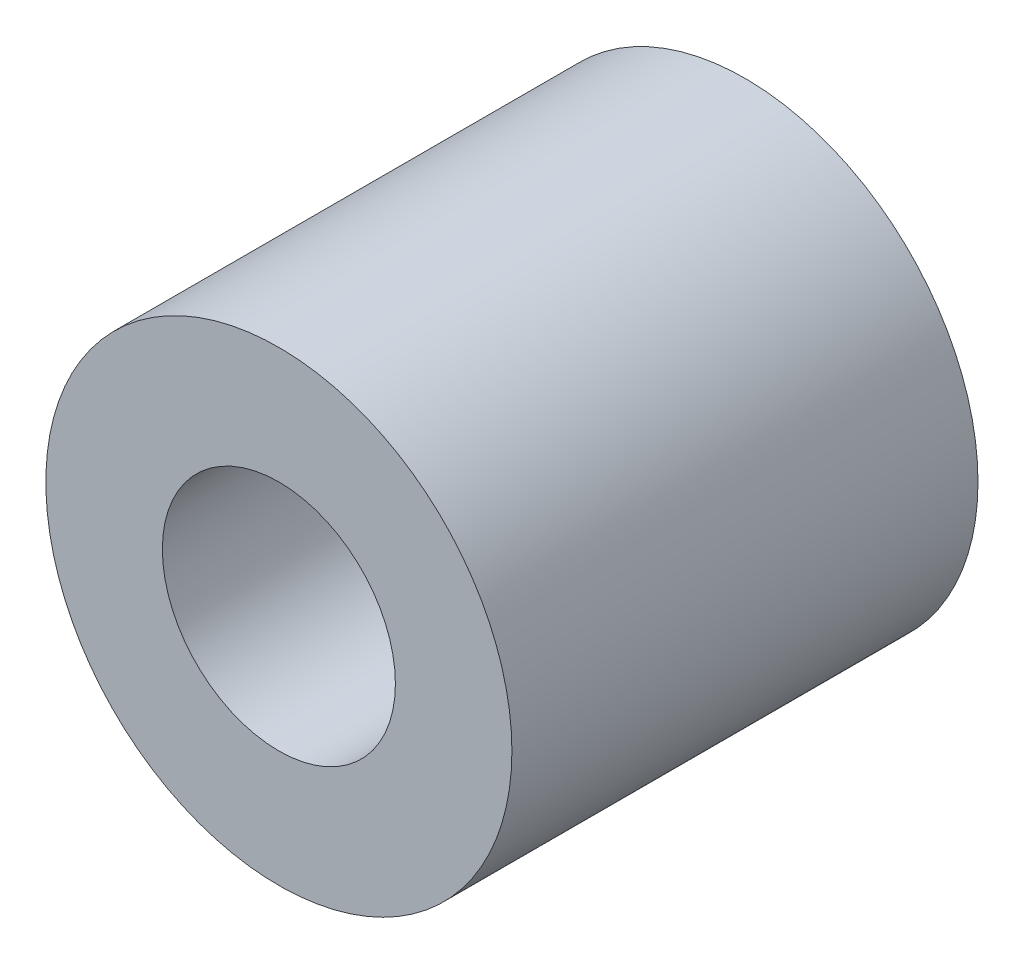
ISO-10303-21;
HEADER;
FILE_DESCRIPTION(('STEP AP214'),'2;1');
FILE_NAME('part.step','',(''),(''),'','','');
FILE_SCHEMA(('AUTOMOTIVE_DESIGN { 1 0 10303 214 1 1 1 1 }'));
ENDSEC;
DATA;
#1=APPLICATION_CONTEXT('core data for automotive mechanical design processes');
#2=APPLICATION_PROTOCOL_DEFINITION('international standard','automotive_design',2000,#1);
#3=PRODUCT_CONTEXT('',#1,'mechanical');
#4=PRODUCT('Part','Part','',(#3));
#5=PRODUCT_RELATED_PRODUCT_CATEGORY('part','',(#4));
#6=PRODUCT_DEFINITION_FORMATION('','',#4);
#7=PRODUCT_DEFINITION_CONTEXT('part definition',#1,'design');
#8=PRODUCT_DEFINITION('design','',#6,#7);
#9=PRODUCT_DEFINITION_SHAPE('','',#8);
#10=(LENGTH_UNIT() NAMED_UNIT(*) SI_UNIT(.MILLI.,.METRE.));
#11=(NAMED_UNIT(*) PLANE_ANGLE_UNIT() SI_UNIT($,.RADIAN.));
#12=(NAMED_UNIT(*) SI_UNIT($,.STERADIAN.) SOLID_ANGLE_UNIT());
#13=UNCERTAINTY_MEASURE_WITH_UNIT(LENGTH_MEASURE(1.E-05),#10,'distance_accuracy_value','');
#14=(GEOMETRIC_REPRESENTATION_CONTEXT(3) GLOBAL_UNCERTAINTY_ASSIGNED_CONTEXT((#13)) GLOBAL_UNIT_ASSIGNED_CONTEXT((#10,
#11,#12)) REPRESENTATION_CONTEXT('',''));
#15=CARTESIAN_POINT('',(0.,0.,0.));
#16=DIRECTION('',(0.,0.,1.));
#17=DIRECTION('',(1.,0.,0.));
#18=AXIS2_PLACEMENT_3D('',#15,#16,#17);
#19=CARTESIAN_POINT('',(0.,0.,25.4));
#20=DIRECTION('',(0.,0.,-1.));
#21=DIRECTION('',(-1.,0.,0.));
#22=AXIS2_PLACEMENT_3D('',#19,#20,#21);
#23=CYLINDRICAL_SURFACE('',#22,12.7);
#24=CARTESIAN_POINT('',(0.,0.,25.4));
#25=DIRECTION('',(0.,0.,1.));
#26=DIRECTION('',(1.,0.,0.));
#27=AXIS2_PLACEMENT_3D('',#24,#25,#26);
#28=CIRCLE('',#27,12.7);
#29=CARTESIAN_POINT('',(12.7,0.,25.4));
#30=VERTEX_POINT('',#29);
#31=EDGE_CURVE('E10',#30,#30,#28,.T.);
#32=ORIENTED_EDGE('',*,*,#31,.F.);
#33=EDGE_LOOP('',(#32));
#34=FACE_BOUND('',#33,.T.);
#35=CARTESIAN_POINT('',(0.,0.,0.));
#36=DIRECTION('',(0.,0.,1.));
#37=DIRECTION('',(1.,0.,0.));
#38=AXIS2_PLACEMENT_3D('',#35,#36,#37);
#39=CIRCLE('',#38,12.7);
#40=CARTESIAN_POINT('',(12.7,0.,0.));
#41=VERTEX_POINT('',#40);
#42=EDGE_CURVE('E40',#41,#41,#39,.T.);
#43=ORIENTED_EDGE('',*,*,#42,.T.);
#44=EDGE_LOOP('',(#43));
#45=FACE_BOUND('',#44,.T.);
#46=ADVANCED_FACE('F37',(#34,#45),#23,.T.);
#47=CARTESIAN_POINT('',(0.,0.,25.4));
#48=DIRECTION('',(0.,0.,1.));
#49=DIRECTION('',(1.,0.,0.));
#50=AXIS2_PLACEMENT_3D('',#47,#48,#49);
#51=PLANE('',#50);
#52=CARTESIAN_POINT('',(0.,0.,25.4));
#53=DIRECTION('',(0.,0.,1.));
#54=DIRECTION('',(1.,0.,0.));
#55=AXIS2_PLACEMENT_3D('',#52,#53,#54);
#56=CIRCLE('',#55,6.35);
#57=CARTESIAN_POINT('',(6.35,0.,25.4));
#58=VERTEX_POINT('',#57);
#59=EDGE_CURVE('E51',#58,#58,#56,.T.);
#60=ORIENTED_EDGE('',*,*,#59,.F.);
#61=EDGE_LOOP('',(#60));
#62=FACE_BOUND('',#61,.T.);
#63=ORIENTED_EDGE('',*,*,#31,.T.);
#64=EDGE_LOOP('',(#63));
#65=FACE_BOUND('',#64,.T.);
#66=ADVANCED_FACE('F68',(#62,#65),#51,.T.);
#67=CARTESIAN_POINT('',(0.,0.,0.));
#68=DIRECTION('',(0.,0.,1.));
#69=DIRECTION('',(1.,0.,0.));
#70=AXIS2_PLACEMENT_3D('',#67,#68,#69);
#71=PLANE('',#70);
#72=CARTESIAN_POINT('',(0.,0.,0.));
#73=DIRECTION('',(0.,0.,1.));
#74=DIRECTION('',(1.,0.,0.));
#75=AXIS2_PLACEMENT_3D('',#72,#73,#74);
#76=CIRCLE('',#75,6.35);
#77=CARTESIAN_POINT('',(6.35,0.,0.));
#78=VERTEX_POINT('',#77);
#79=EDGE_CURVE('E49',#78,#78,#76,.T.);
#80=ORIENTED_EDGE('',*,*,#79,.T.);
#81=EDGE_LOOP('',(#80));
#82=FACE_BOUND('',#81,.T.);
#83=ORIENTED_EDGE('',*,*,#42,.F.);
#84=EDGE_LOOP('',(#83));
#85=FACE_BOUND('',#84,.T.);
#86=ADVANCED_FACE('F59',(#82,#85),#71,.F.);
#87=CARTESIAN_POINT('',(0.,0.,0.));
#88=DIRECTION('',(0.,0.,1.));
#89=DIRECTION('',(1.,0.,0.));
#90=AXIS2_PLACEMENT_3D('',#87,#88,#89);
#91=CYLINDRICAL_SURFACE('',#90,6.35);
#92=ORIENTED_EDGE('',*,*,#79,.F.);
#93=EDGE_LOOP('',(#92));
#94=FACE_BOUND('',#93,.T.);
#95=ORIENTED_EDGE('',*,*,#59,.T.);
#96=EDGE_LOOP('',(#95));
#97=FACE_BOUND('',#96,.T.);
#98=ADVANCED_FACE('F62',(#94,#97),#91,.F.);
#99=CLOSED_SHELL('',(#46,#66,#86,#98));
#100=MANIFOLD_SOLID_BREP('B2',#99);
#101=ADVANCED_BREP_SHAPE_REPRESENTATION('',(#18,#100),#14);
#102=SHAPE_DEFINITION_REPRESENTATION(#9,#101);
ENDSEC;
END-ISO-10303-21;
